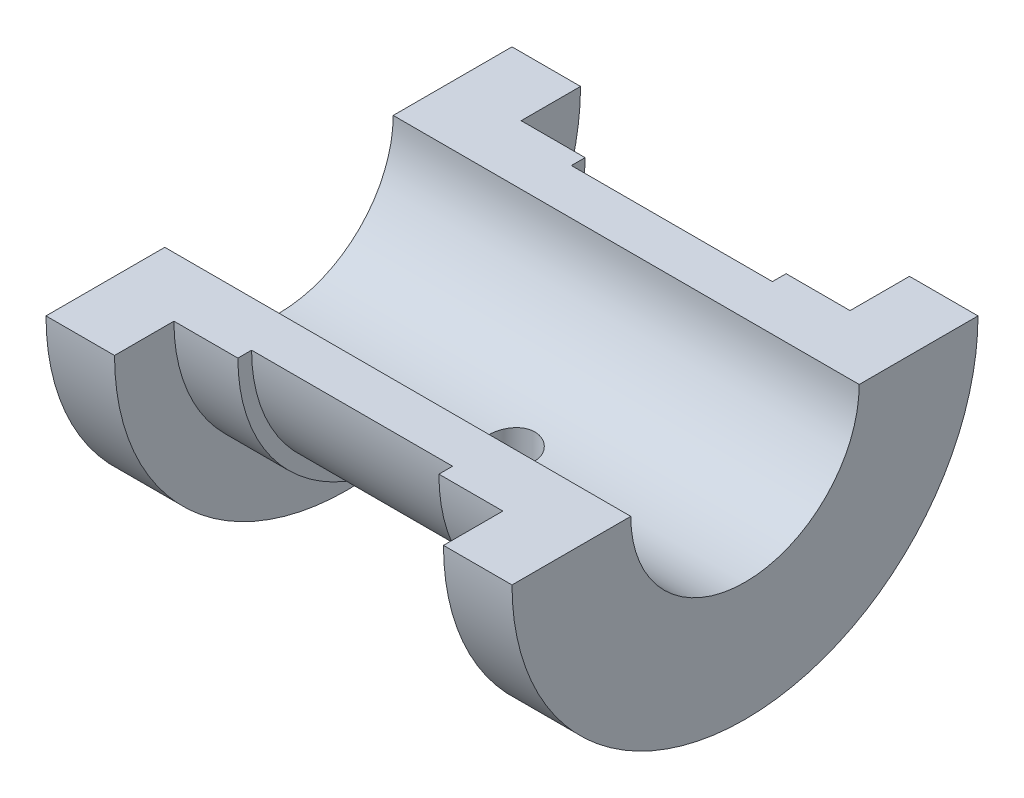
ISO-10303-21;
HEADER;
FILE_DESCRIPTION(('STEP AP214'),'2;1');
FILE_NAME('part.step','',(''),(''),'','','');
FILE_SCHEMA(('AUTOMOTIVE_DESIGN { 1 0 10303 214 1 1 1 1 }'));
ENDSEC;
DATA;
#1=APPLICATION_CONTEXT('core data for automotive mechanical design processes');
#2=APPLICATION_PROTOCOL_DEFINITION('international standard','automotive_design',2000,#1);
#3=PRODUCT_CONTEXT('',#1,'mechanical');
#4=PRODUCT('Part','Part','',(#3));
#5=PRODUCT_RELATED_PRODUCT_CATEGORY('part','',(#4));
#6=PRODUCT_DEFINITION_FORMATION('','',#4);
#7=PRODUCT_DEFINITION_CONTEXT('part definition',#1,'design');
#8=PRODUCT_DEFINITION('design','',#6,#7);
#9=PRODUCT_DEFINITION_SHAPE('','',#8);
#10=(LENGTH_UNIT() NAMED_UNIT(*) SI_UNIT(.MILLI.,.METRE.));
#11=(NAMED_UNIT(*) PLANE_ANGLE_UNIT() SI_UNIT($,.RADIAN.));
#12=(NAMED_UNIT(*) SI_UNIT($,.STERADIAN.) SOLID_ANGLE_UNIT());
#13=UNCERTAINTY_MEASURE_WITH_UNIT(LENGTH_MEASURE(1.E-05),#10,'distance_accuracy_value','');
#14=(GEOMETRIC_REPRESENTATION_CONTEXT(3) GLOBAL_UNCERTAINTY_ASSIGNED_CONTEXT((#13)) GLOBAL_UNIT_ASSIGNED_CONTEXT((#10,
#11,#12)) REPRESENTATION_CONTEXT('',''));
#15=CARTESIAN_POINT('',(0.,0.,0.));
#16=DIRECTION('',(0.,0.,1.));
#17=DIRECTION('',(1.,0.,0.));
#18=AXIS2_PLACEMENT_3D('',#15,#16,#17);
#19=CARTESIAN_POINT('',(0.,0.,0.));
#20=DIRECTION('',(0.,1.,0.));
#21=DIRECTION('',(0.,0.,1.));
#22=AXIS2_PLACEMENT_3D('',#19,#20,#21);
#23=PLANE('',#22);
#24=DIRECTION('',(-1.,0.,0.));
#25=VECTOR('',#24,1.);
#26=CARTESIAN_POINT('',(25.5,0.,-12.5));
#27=LINE('',#26,#25);
#28=CARTESIAN_POINT('',(25.5,0.,-12.5));
#29=VERTEX_POINT('',#28);
#30=CARTESIAN_POINT('',(-25.5,0.,-12.5));
#31=VERTEX_POINT('',#30);
#32=EDGE_CURVE('E132',#29,#31,#27,.T.);
#33=ORIENTED_EDGE('',*,*,#32,.F.);
#34=DIRECTION('',(0.,0.,1.));
#35=VECTOR('',#34,1.);
#36=CARTESIAN_POINT('',(25.5,0.,0.));
#37=LINE('',#36,#35);
#38=CARTESIAN_POINT('',(25.5,0.,-25.5));
#39=VERTEX_POINT('',#38);
#40=EDGE_CURVE('E140',#39,#29,#37,.T.);
#41=ORIENTED_EDGE('',*,*,#40,.F.);
#42=DIRECTION('',(-1.,0.,0.));
#43=VECTOR('',#42,1.);
#44=CARTESIAN_POINT('',(25.5,0.,-25.5));
#45=LINE('',#44,#43);
#46=CARTESIAN_POINT('',(18.,0.,-25.5));
#47=VERTEX_POINT('',#46);
#48=EDGE_CURVE('E209',#39,#47,#45,.T.);
#49=ORIENTED_EDGE('',*,*,#48,.T.);
#50=DIRECTION('',(0.,0.,1.));
#51=VECTOR('',#50,1.);
#52=CARTESIAN_POINT('',(18.,0.,-25.5));
#53=LINE('',#52,#51);
#54=CARTESIAN_POINT('',(18.,0.,-19.));
#55=VERTEX_POINT('',#54);
#56=EDGE_CURVE('E212',#47,#55,#53,.T.);
#57=ORIENTED_EDGE('',*,*,#56,.T.);
#58=DIRECTION('',(-1.,0.,0.));
#59=VECTOR('',#58,1.);
#60=CARTESIAN_POINT('',(18.,0.,-19.));
#61=LINE('',#60,#59);
#62=CARTESIAN_POINT('',(11.,0.,-19.));
#63=VERTEX_POINT('',#62);
#64=EDGE_CURVE('E218',#55,#63,#61,.T.);
#65=ORIENTED_EDGE('',*,*,#64,.T.);
#66=DIRECTION('',(0.,0.,1.));
#67=VECTOR('',#66,1.);
#68=CARTESIAN_POINT('',(11.,0.,-19.));
#69=LINE('',#68,#67);
#70=CARTESIAN_POINT('',(11.,0.,-17.5));
#71=VERTEX_POINT('',#70);
#72=EDGE_CURVE('E221',#63,#71,#69,.T.);
#73=ORIENTED_EDGE('',*,*,#72,.T.);
#74=DIRECTION('',(-1.,0.,0.));
#75=VECTOR('',#74,1.);
#76=CARTESIAN_POINT('',(-11.,0.,-17.5));
#77=LINE('',#76,#75);
#78=CARTESIAN_POINT('',(-11.,0.,-17.5));
#79=VERTEX_POINT('',#78);
#80=EDGE_CURVE('E224',#71,#79,#77,.T.);
#81=ORIENTED_EDGE('',*,*,#80,.T.);
#82=DIRECTION('',(0.,0.,-1.));
#83=VECTOR('',#82,1.);
#84=CARTESIAN_POINT('',(-11.,0.,-19.));
#85=LINE('',#84,#83);
#86=CARTESIAN_POINT('',(-11.,0.,-19.));
#87=VERTEX_POINT('',#86);
#88=EDGE_CURVE('E227',#79,#87,#85,.T.);
#89=ORIENTED_EDGE('',*,*,#88,.T.);
#90=DIRECTION('',(-1.,0.,0.));
#91=VECTOR('',#90,1.);
#92=CARTESIAN_POINT('',(-18.,0.,-19.));
#93=LINE('',#92,#91);
#94=CARTESIAN_POINT('',(-18.,0.,-19.));
#95=VERTEX_POINT('',#94);
#96=EDGE_CURVE('E205',#87,#95,#93,.T.);
#97=ORIENTED_EDGE('',*,*,#96,.T.);
#98=DIRECTION('',(0.,0.,-1.));
#99=VECTOR('',#98,1.);
#100=CARTESIAN_POINT('',(-18.,0.,-25.5));
#101=LINE('',#100,#99);
#102=CARTESIAN_POINT('',(-18.,0.,-25.5));
#103=VERTEX_POINT('',#102);
#104=EDGE_CURVE('E195',#95,#103,#101,.T.);
#105=ORIENTED_EDGE('',*,*,#104,.T.);
#106=DIRECTION('',(-1.,0.,0.));
#107=VECTOR('',#106,1.);
#108=CARTESIAN_POINT('',(-25.5,0.,-25.5));
#109=LINE('',#108,#107);
#110=CARTESIAN_POINT('',(-25.5,0.,-25.5));
#111=VERTEX_POINT('',#110);
#112=EDGE_CURVE('E202',#103,#111,#109,.T.);
#113=ORIENTED_EDGE('',*,*,#112,.T.);
#114=DIRECTION('',(0.,0.,-1.));
#115=VECTOR('',#114,1.);
#116=CARTESIAN_POINT('',(-25.5,0.,0.));
#117=LINE('',#116,#115);
#118=EDGE_CURVE('E149',#31,#111,#117,.T.);
#119=ORIENTED_EDGE('',*,*,#118,.F.);
#120=EDGE_LOOP('',(#33,#41,#49,#57,#65,#73,#81,#89,#97,#105,#113,#119));
#121=FACE_BOUND('',#120,.T.);
#122=ADVANCED_FACE('F33',(#121),#23,.T.);
#123=CARTESIAN_POINT('',(25.5,0.,0.));
#124=DIRECTION('',(1.,0.,0.));
#125=DIRECTION('',(0.,0.,-1.));
#126=AXIS2_PLACEMENT_3D('',#123,#124,#125);
#127=CYLINDRICAL_SURFACE('',#126,25.5);
#128=CARTESIAN_POINT('',(-18.,0.,0.));
#129=DIRECTION('',(1.,0.,0.));
#130=DIRECTION('',(0.,0.,-1.));
#131=AXIS2_PLACEMENT_3D('',#128,#129,#130);
#132=CIRCLE('',#131,25.5);
#133=CARTESIAN_POINT('',(-18.,1.78065548281E-13,25.5));
#134=VERTEX_POINT('',#133);
#135=EDGE_CURVE('E45',#134,#103,#132,.T.);
#136=ORIENTED_EDGE('',*,*,#135,.F.);
#137=DIRECTION('',(-1.,0.,0.));
#138=VECTOR('',#137,1.);
#139=CARTESIAN_POINT('',(-25.5,1.78065548281E-13,25.5));
#140=LINE('',#139,#138);
#141=CARTESIAN_POINT('',(-25.5,1.78065548281E-13,25.5));
#142=VERTEX_POINT('',#141);
#143=EDGE_CURVE('E206',#134,#142,#140,.T.);
#144=ORIENTED_EDGE('',*,*,#143,.T.);
#145=CARTESIAN_POINT('',(-25.5,0.,0.));
#146=DIRECTION('',(1.,0.,0.));
#147=DIRECTION('',(0.,0.,-1.));
#148=AXIS2_PLACEMENT_3D('',#145,#146,#147);
#149=CIRCLE('',#148,25.5);
#150=EDGE_CURVE('E174',#142,#111,#149,.T.);
#151=ORIENTED_EDGE('',*,*,#150,.T.);
#152=ORIENTED_EDGE('',*,*,#112,.F.);
#153=EDGE_LOOP('',(#136,#144,#151,#152));
#154=FACE_BOUND('',#153,.T.);
#155=ADVANCED_FACE('F208',(#154),#127,.T.);
#156=CARTESIAN_POINT('',(-18.,1.78065548281E-13,25.5));
#157=DIRECTION('',(1.,0.,0.));
#158=DIRECTION('',(0.,0.,-1.));
#159=AXIS2_PLACEMENT_3D('',#156,#157,#158);
#160=PLANE('',#159);
#161=CARTESIAN_POINT('',(-18.,0.,0.));
#162=DIRECTION('',(1.,0.,0.));
#163=DIRECTION('',(0.,0.,-1.));
#164=AXIS2_PLACEMENT_3D('',#161,#162,#163);
#165=CIRCLE('',#164,19.);
#166=CARTESIAN_POINT('',(-18.,1.32676290876039E-13,19.));
#167=VERTEX_POINT('',#166);
#168=EDGE_CURVE('E191',#167,#95,#165,.T.);
#169=ORIENTED_EDGE('',*,*,#168,.F.);
#170=DIRECTION('',(0.,0.,1.));
#171=VECTOR('',#170,1.);
#172=CARTESIAN_POINT('',(-18.,1.78065548281E-13,25.5));
#173=LINE('',#172,#171);
#174=EDGE_CURVE('E172',#167,#134,#173,.T.);
#175=ORIENTED_EDGE('',*,*,#174,.T.);
#176=ORIENTED_EDGE('',*,*,#135,.T.);
#177=ORIENTED_EDGE('',*,*,#104,.F.);
#178=EDGE_LOOP('',(#169,#175,#176,#177));
#179=FACE_BOUND('',#178,.T.);
#180=ADVANCED_FACE('F35',(#179),#160,.T.);
#181=CARTESIAN_POINT('',(25.5,0.,0.));
#182=DIRECTION('',(1.,0.,0.));
#183=DIRECTION('',(0.,0.,-1.));
#184=AXIS2_PLACEMENT_3D('',#181,#182,#183);
#185=CYLINDRICAL_SURFACE('',#184,19.);
#186=CARTESIAN_POINT('',(-11.,0.,0.));
#187=DIRECTION('',(1.,0.,0.));
#188=DIRECTION('',(0.,0.,-1.));
#189=AXIS2_PLACEMENT_3D('',#186,#187,#188);
#190=CIRCLE('',#189,19.);
#191=CARTESIAN_POINT('',(-11.,1.32676290876039E-13,19.));
#192=VERTEX_POINT('',#191);
#193=EDGE_CURVE('E189',#192,#87,#190,.T.);
#194=ORIENTED_EDGE('',*,*,#193,.F.);
#195=DIRECTION('',(-1.,0.,0.));
#196=VECTOR('',#195,1.);
#197=CARTESIAN_POINT('',(-18.,1.32676290876039E-13,19.));
#198=LINE('',#197,#196);
#199=EDGE_CURVE('E169',#192,#167,#198,.T.);
#200=ORIENTED_EDGE('',*,*,#199,.T.);
#201=ORIENTED_EDGE('',*,*,#168,.T.);
#202=ORIENTED_EDGE('',*,*,#96,.F.);
#203=EDGE_LOOP('',(#194,#200,#201,#202));
#204=FACE_BOUND('',#203,.T.);
#205=ADVANCED_FACE('F255',(#204),#185,.T.);
#206=CARTESIAN_POINT('',(-11.,1.32676290876039E-13,19.));
#207=DIRECTION('',(1.,0.,0.));
#208=DIRECTION('',(0.,0.,-1.));
#209=AXIS2_PLACEMENT_3D('',#206,#207,#208);
#210=PLANE('',#209);
#211=CARTESIAN_POINT('',(-11.,0.,0.));
#212=DIRECTION('',(1.,0.,0.));
#213=DIRECTION('',(0.,0.,-1.));
#214=AXIS2_PLACEMENT_3D('',#211,#212,#213);
#215=CIRCLE('',#214,17.5);
#216=CARTESIAN_POINT('',(-11.,1.2220184685951E-13,17.5));
#217=VERTEX_POINT('',#216);
#218=EDGE_CURVE('E187',#217,#79,#215,.T.);
#219=ORIENTED_EDGE('',*,*,#218,.F.);
#220=DIRECTION('',(0.,0.,1.));
#221=VECTOR('',#220,1.);
#222=CARTESIAN_POINT('',(-11.,1.32676290876039E-13,19.));
#223=LINE('',#222,#221);
#224=EDGE_CURVE('E166',#217,#192,#223,.T.);
#225=ORIENTED_EDGE('',*,*,#224,.T.);
#226=ORIENTED_EDGE('',*,*,#193,.T.);
#227=ORIENTED_EDGE('',*,*,#88,.F.);
#228=EDGE_LOOP('',(#219,#225,#226,#227));
#229=FACE_BOUND('',#228,.T.);
#230=ADVANCED_FACE('F252',(#229),#210,.T.);
#231=CARTESIAN_POINT('',(25.5,0.,0.));
#232=DIRECTION('',(1.,0.,0.));
#233=DIRECTION('',(0.,0.,-1.));
#234=AXIS2_PLACEMENT_3D('',#231,#232,#233);
#235=CYLINDRICAL_SURFACE('',#234,17.5);
#236=CARTESIAN_POINT('',(0.,-17.3205080756888,-2.49999999999999));
#237=CARTESIAN_POINT('',(0.139655214050539,-17.3205103214296,-2.4999941764498));
#238=CARTESIAN_POINT('',(0.279393390965435,-17.3222153996634,-2.488258306336));
#239=CARTESIAN_POINT('',(0.554968295528884,-17.3288474891277,-2.44163425172346));
#240=CARTESIAN_POINT('',(0.690800994393875,-17.3337777110364,-2.40672299527128));
#241=CARTESIAN_POINT('',(0.954535875036129,-17.346290533042,-2.31480923545586));
#242=CARTESIAN_POINT('',(1.08244384762566,-17.3538711688453,-2.25782308902599));
#243=CARTESIAN_POINT('',(1.32686216183505,-17.3708283324759,-2.12341469861513));
#244=CARTESIAN_POINT('',(1.44337418380036,-17.3802045949313,-2.04599547375905));
#245=CARTESIAN_POINT('',(1.66256036980916,-17.3997728156945,-1.87231683550245));
#246=CARTESIAN_POINT('',(1.76513964233235,-17.4099696809091,-1.77593820534161));
#247=CARTESIAN_POINT('',(1.95272694655072,-17.4299862889805,-1.56733384870893));
#248=CARTESIAN_POINT('',(2.03773404080034,-17.4398060116945,-1.4551072773139));
#249=CARTESIAN_POINT('',(2.1881113721996,-17.4580129627861,-1.21738798002561));
#250=CARTESIAN_POINT('',(2.25339464314803,-17.4663937786684,-1.09183970777011));
#251=CARTESIAN_POINT('',(2.36191341915977,-17.4807243931613,-0.831420932453869));
#252=CARTESIAN_POINT('',(2.40514998330924,-17.4866743085456,-0.696550877549161));
#253=CARTESIAN_POINT('',(2.46806150870533,-17.4954381251122,-0.422292579426188));
#254=CARTESIAN_POINT('',(2.48789508745779,-17.4982731289764,-0.282941406337348));
#255=CARTESIAN_POINT('',(2.50392987320824,-17.5005599435479,-0.00286195659799968));
#256=CARTESIAN_POINT('',(2.50013227745763,-17.5000119256529,0.137866249925722));
#257=CARTESIAN_POINT('',(2.46913827723023,-17.4956113682908,0.415623740232335));
#258=CARTESIAN_POINT('',(2.44211250139685,-17.4917829266554,0.552672499713791));
#259=CARTESIAN_POINT('',(2.36569680037598,-17.4812785676579,0.820269493910864));
#260=CARTESIAN_POINT('',(2.31630634376525,-17.4746025826336,0.950817574077351));
#261=CARTESIAN_POINT('',(2.19638656902053,-17.4591117546373,1.20222745845967));
#262=CARTESIAN_POINT('',(2.12578481110144,-17.4502896021464,1.32305424098883));
#263=CARTESIAN_POINT('',(1.96549938407467,-17.4314908337029,1.55120977517205));
#264=CARTESIAN_POINT('',(1.87581457419597,-17.4215141487494,1.65853771926478));
#265=CARTESIAN_POINT('',(1.67895674790501,-17.4014150617975,1.85765373882982));
#266=CARTESIAN_POINT('',(1.57163483406351,-17.3912921538904,1.94929461665229));
#267=CARTESIAN_POINT('',(1.34305684821314,-17.3721286734458,2.11328736987653));
#268=CARTESIAN_POINT('',(1.22180070481798,-17.3630881064538,2.18563914645222));
#269=CARTESIAN_POINT('',(0.968649637617275,-17.3471131710366,2.30901626900993));
#270=CARTESIAN_POINT('',(0.836747742646744,-17.3401801971233,2.36002750314722));
#271=CARTESIAN_POINT('',(0.56612802521764,-17.3292308226119,2.439132796354));
#272=CARTESIAN_POINT('',(0.427410637010548,-17.3252142364516,2.46722831350377));
#273=CARTESIAN_POINT('',(0.148404328212451,-17.3205872594665,2.49950488360241));
#274=CARTESIAN_POINT('',(0.00813996750552049,-17.3199472150388,2.50389413880589));
#275=CARTESIAN_POINT('',(-0.271122256281437,-17.3220671566589,2.489185103089));
#276=CARTESIAN_POINT('',(-0.410120154779109,-17.3248270473289,2.47008747104212));
#277=CARTESIAN_POINT('',(-0.682265225035556,-17.3334087065645,2.40912297319001));
#278=CARTESIAN_POINT('',(-0.815435908831674,-17.3392166418156,2.36735894805525));
#279=CARTESIAN_POINT('',(-1.07288599682062,-17.3532286401521,2.26235382714329));
#280=CARTESIAN_POINT('',(-1.19716499945215,-17.3614328113701,2.19911176212676));
#281=CARTESIAN_POINT('',(-1.43423984965186,-17.3793831051677,2.05244200414031));
#282=CARTESIAN_POINT('',(-1.54695120151544,-17.3891394056538,1.96887900033906));
#283=CARTESIAN_POINT('',(-1.75682465453188,-17.4090636358241,1.78412847276705));
#284=CARTESIAN_POINT('',(-1.8539859600739,-17.4192315865368,1.6829400477527));
#285=CARTESIAN_POINT('',(-2.03074402304224,-17.4389256551739,1.46489635785669));
#286=CARTESIAN_POINT('',(-2.1102031528994,-17.4484463695232,1.34792896515541));
#287=CARTESIAN_POINT('',(-2.24834445391965,-17.4656902694975,1.10218588096399));
#288=CARTESIAN_POINT('',(-2.30702714967243,-17.4734135005061,0.973410487720567));
#289=CARTESIAN_POINT('',(-2.40172764289464,-17.4861684730555,0.708144905742415));
#290=CARTESIAN_POINT('',(-2.43782198578435,-17.4912092957152,0.571682498904912));
#291=CARTESIAN_POINT('',(-2.48656933388325,-17.4980694889566,0.294556573807231));
#292=CARTESIAN_POINT('',(-2.4992237373173,-17.4998890516906,0.153893306642845));
#293=CARTESIAN_POINT('',(-2.50070029868059,-17.5001000958988,-0.126303913283942));
#294=CARTESIAN_POINT('',(-2.48973352377306,-17.4985219377795,-0.265836777188218));
#295=CARTESIAN_POINT('',(-2.44472981244618,-17.4921758034385,-0.541053291849848));
#296=CARTESIAN_POINT('',(-2.41069293049507,-17.4874078347479,-0.676736951694339));
#297=CARTESIAN_POINT('',(-2.32058752821483,-17.4752152756766,-0.94035464312152));
#298=CARTESIAN_POINT('',(-2.26453227439438,-17.4677922852398,-1.06829328775858));
#299=CARTESIAN_POINT('',(-2.13200356349716,-17.4511070012847,-1.31298213231449));
#300=CARTESIAN_POINT('',(-2.05552956867624,-17.4418446593271,-1.42973203745873));
#301=CARTESIAN_POINT('',(-1.88356535597191,-17.4224130932707,-1.64980243700276));
#302=CARTESIAN_POINT('',(-1.78791886646362,-17.4122368231533,-1.75300020789776));
#303=CARTESIAN_POINT('',(-1.58065304970162,-17.3921777929122,-1.94195895909258));
#304=CARTESIAN_POINT('',(-1.46902997123847,-17.3822951023791,-2.02771583289178));
#305=CARTESIAN_POINT('',(-1.23231820209395,-17.3638885978291,-2.17974404343877));
#306=CARTESIAN_POINT('',(-1.10716413704061,-17.3553719241531,-2.24591442873637));
#307=CARTESIAN_POINT('',(-0.847459629299107,-17.3407453505435,-2.35619878131273));
#308=CARTESIAN_POINT('',(-0.712919252117549,-17.3346329177213,-2.40033597402073));
#309=CARTESIAN_POINT('',(-0.481454467704522,-17.3269411528971,-2.45511568957329));
#310=CARTESIAN_POINT('',(-0.385969580734816,-17.3245412999151,-2.47192203162012));
#311=CARTESIAN_POINT('',(-0.193669753794692,-17.3213239914062,-2.49436614385581));
#312=CARTESIAN_POINT('',(-0.0968548286929663,-17.3205065182042,-2.50000403879626));
#313=CARTESIAN_POINT('',(0.,-17.3205080756888,-2.49999999999999));
#314=B_SPLINE_CURVE_WITH_KNOTS('',3,(#236,#237,#238,#239,#240,#241,#242,#243,#244,#245,#246,
#247,#248,#249,#250,#251,#252,#253,#254,#255,#256,#257,#258,#259,#260,#261,#262,#263,#264,#265,
#266,#267,#268,#269,#270,#271,#272,#273,#274,#275,#276,#277,#278,#279,#280,#281,#282,#283,#284,
#285,#286,#287,#288,#289,#290,#291,#292,#293,#294,#295,#296,#297,#298,#299,#300,#301,#302,#303,
#304,#305,#306,#307,#308,#309,#310,#311,#312,#313),.UNSPECIFIED.,.T.,.F.,(4,2,2,2,2,2,2,2,2,2,2,
2,2,2,2,2,2,2,2,2,2,2,2,2,2,2,2,2,2,2,2,2,2,2,2,2,2,2,4),(0.,0.418611686761215,
0.837640743157849,1.25635990174198,1.67501722635384,2.09639644561274,2.51779813893171,
2.94103163345003,3.36424479463774,3.78457277673271,4.20487946347623,4.622124811343,
5.03938007419638,5.45807684551731,5.87679865326297,6.29925647482802,6.72171646077845,
7.14445536663835,7.56716737238592,7.98616076353197,8.40514240099879,8.8222387600537,
9.23935394391403,9.65932651264326,10.0793205622075,10.502474019027,10.9256167907707,
11.3473177767363,11.7689936068437,12.1869171913008,12.6048397890487,13.022510965389,
13.4401931425248,13.8614293663582,14.2827646567287,14.7062351939403,15.1292583986303,
15.4195806495844,15.7098996576198),.UNSPECIFIED.);
#315=CARTESIAN_POINT('',(0.,-17.3205080756888,-2.49999999999999));
#316=VERTEX_POINT('',#315);
#317=EDGE_CURVE('E11',#316,#316,#314,.T.);
#318=ORIENTED_EDGE('',*,*,#317,.F.);
#319=EDGE_LOOP('',(#318));
#320=FACE_BOUND('',#319,.T.);
#321=CARTESIAN_POINT('',(11.,0.,0.));
#322=DIRECTION('',(1.,0.,0.));
#323=DIRECTION('',(0.,0.,-1.));
#324=AXIS2_PLACEMENT_3D('',#321,#322,#323);
#325=CIRCLE('',#324,17.5);
#326=CARTESIAN_POINT('',(11.,1.2220184685951E-13,17.5));
#327=VERTEX_POINT('',#326);
#328=EDGE_CURVE('E185',#327,#71,#325,.T.);
#329=ORIENTED_EDGE('',*,*,#328,.F.);
#330=DIRECTION('',(-1.,0.,0.));
#331=VECTOR('',#330,1.);
#332=CARTESIAN_POINT('',(-11.,1.2220184685951E-13,17.5));
#333=LINE('',#332,#331);
#334=EDGE_CURVE('E163',#327,#217,#333,.T.);
#335=ORIENTED_EDGE('',*,*,#334,.T.);
#336=ORIENTED_EDGE('',*,*,#218,.T.);
#337=ORIENTED_EDGE('',*,*,#80,.F.);
#338=EDGE_LOOP('',(#329,#335,#336,#337));
#339=FACE_BOUND('',#338,.T.);
#340=ADVANCED_FACE('F249',(#320,#339),#235,.T.);
#341=CARTESIAN_POINT('',(11.,1.32676290876039E-13,19.));
#342=DIRECTION('',(-1.,0.,0.));
#343=DIRECTION('',(0.,0.,1.));
#344=AXIS2_PLACEMENT_3D('',#341,#342,#343);
#345=PLANE('',#344);
#346=CARTESIAN_POINT('',(11.,0.,0.));
#347=DIRECTION('',(1.,0.,0.));
#348=DIRECTION('',(0.,0.,-1.));
#349=AXIS2_PLACEMENT_3D('',#346,#347,#348);
#350=CIRCLE('',#349,19.);
#351=CARTESIAN_POINT('',(11.,1.32676290876039E-13,19.));
#352=VERTEX_POINT('',#351);
#353=EDGE_CURVE('E183',#352,#63,#350,.T.);
#354=ORIENTED_EDGE('',*,*,#353,.F.);
#355=DIRECTION('',(0.,0.,-1.));
#356=VECTOR('',#355,1.);
#357=CARTESIAN_POINT('',(11.,1.32676290876039E-13,19.));
#358=LINE('',#357,#356);
#359=EDGE_CURVE('E160',#352,#327,#358,.T.);
#360=ORIENTED_EDGE('',*,*,#359,.T.);
#361=ORIENTED_EDGE('',*,*,#328,.T.);
#362=ORIENTED_EDGE('',*,*,#72,.F.);
#363=EDGE_LOOP('',(#354,#360,#361,#362));
#364=FACE_BOUND('',#363,.T.);
#365=ADVANCED_FACE('F244',(#364),#345,.T.);
#366=CARTESIAN_POINT('',(25.5,0.,0.));
#367=DIRECTION('',(1.,0.,0.));
#368=DIRECTION('',(0.,0.,-1.));
#369=AXIS2_PLACEMENT_3D('',#366,#367,#368);
#370=CYLINDRICAL_SURFACE('',#369,19.);
#371=CARTESIAN_POINT('',(18.,0.,0.));
#372=DIRECTION('',(1.,0.,0.));
#373=DIRECTION('',(0.,0.,-1.));
#374=AXIS2_PLACEMENT_3D('',#371,#372,#373);
#375=CIRCLE('',#374,19.);
#376=CARTESIAN_POINT('',(18.,1.32676290876039E-13,19.));
#377=VERTEX_POINT('',#376);
#378=EDGE_CURVE('E181',#377,#55,#375,.T.);
#379=ORIENTED_EDGE('',*,*,#378,.F.);
#380=DIRECTION('',(-1.,0.,0.));
#381=VECTOR('',#380,1.);
#382=CARTESIAN_POINT('',(18.,1.32676290876039E-13,19.));
#383=LINE('',#382,#381);
#384=EDGE_CURVE('E157',#377,#352,#383,.T.);
#385=ORIENTED_EDGE('',*,*,#384,.T.);
#386=ORIENTED_EDGE('',*,*,#353,.T.);
#387=ORIENTED_EDGE('',*,*,#64,.F.);
#388=EDGE_LOOP('',(#379,#385,#386,#387));
#389=FACE_BOUND('',#388,.T.);
#390=ADVANCED_FACE('F241',(#389),#370,.T.);
#391=CARTESIAN_POINT('',(18.,1.78065548281E-13,25.5));
#392=DIRECTION('',(-1.,0.,0.));
#393=DIRECTION('',(0.,0.,1.));
#394=AXIS2_PLACEMENT_3D('',#391,#392,#393);
#395=PLANE('',#394);
#396=CARTESIAN_POINT('',(18.,0.,0.));
#397=DIRECTION('',(1.,0.,0.));
#398=DIRECTION('',(0.,0.,-1.));
#399=AXIS2_PLACEMENT_3D('',#396,#397,#398);
#400=CIRCLE('',#399,25.5);
#401=CARTESIAN_POINT('',(18.,1.78065548281E-13,25.5));
#402=VERTEX_POINT('',#401);
#403=EDGE_CURVE('E179',#402,#47,#400,.T.);
#404=ORIENTED_EDGE('',*,*,#403,.F.);
#405=DIRECTION('',(0.,0.,-1.));
#406=VECTOR('',#405,1.);
#407=CARTESIAN_POINT('',(18.,1.78065548281E-13,25.5));
#408=LINE('',#407,#406);
#409=EDGE_CURVE('E154',#402,#377,#408,.T.);
#410=ORIENTED_EDGE('',*,*,#409,.T.);
#411=ORIENTED_EDGE('',*,*,#378,.T.);
#412=ORIENTED_EDGE('',*,*,#56,.F.);
#413=EDGE_LOOP('',(#404,#410,#411,#412));
#414=FACE_BOUND('',#413,.T.);
#415=ADVANCED_FACE('F236',(#414),#395,.T.);
#416=CARTESIAN_POINT('',(25.5,0.,0.));
#417=DIRECTION('',(1.,0.,0.));
#418=DIRECTION('',(0.,0.,-1.));
#419=AXIS2_PLACEMENT_3D('',#416,#417,#418);
#420=CYLINDRICAL_SURFACE('',#419,25.5);
#421=CARTESIAN_POINT('',(25.5,0.,0.));
#422=DIRECTION('',(1.,0.,0.));
#423=DIRECTION('',(0.,0.,-1.));
#424=AXIS2_PLACEMENT_3D('',#421,#422,#423);
#425=CIRCLE('',#424,25.5);
#426=CARTESIAN_POINT('',(25.5,1.78065548281E-13,25.5));
#427=VERTEX_POINT('',#426);
#428=EDGE_CURVE('E177',#427,#39,#425,.T.);
#429=ORIENTED_EDGE('',*,*,#428,.F.);
#430=DIRECTION('',(-1.,0.,0.));
#431=VECTOR('',#430,1.);
#432=CARTESIAN_POINT('',(25.5,1.78065548281E-13,25.5));
#433=LINE('',#432,#431);
#434=EDGE_CURVE('E146',#427,#402,#433,.T.);
#435=ORIENTED_EDGE('',*,*,#434,.T.);
#436=ORIENTED_EDGE('',*,*,#403,.T.);
#437=ORIENTED_EDGE('',*,*,#48,.F.);
#438=EDGE_LOOP('',(#429,#435,#436,#437));
#439=FACE_BOUND('',#438,.T.);
#440=ADVANCED_FACE('F234',(#439),#420,.T.);
#441=CARTESIAN_POINT('',(25.5,0.,0.));
#442=DIRECTION('',(1.,0.,0.));
#443=DIRECTION('',(0.,0.,-1.));
#444=AXIS2_PLACEMENT_3D('',#441,#442,#443);
#445=PLANE('',#444);
#446=CARTESIAN_POINT('',(25.5,0.,0.));
#447=DIRECTION('',(-1.,0.,0.));
#448=DIRECTION('',(0.,0.,1.));
#449=AXIS2_PLACEMENT_3D('',#446,#447,#448);
#450=CIRCLE('',#449,12.5);
#451=CARTESIAN_POINT('',(25.5,1.32676290876039E-13,12.5));
#452=VERTEX_POINT('',#451);
#453=EDGE_CURVE('E126',#29,#452,#450,.T.);
#454=ORIENTED_EDGE('',*,*,#453,.T.);
#455=EDGE_CURVE('E138',#452,#427,#37,.T.);
#456=ORIENTED_EDGE('',*,*,#455,.T.);
#457=ORIENTED_EDGE('',*,*,#428,.T.);
#458=ORIENTED_EDGE('',*,*,#40,.T.);
#459=EDGE_LOOP('',(#454,#456,#457,#458));
#460=FACE_BOUND('',#459,.T.);
#461=ADVANCED_FACE('F136',(#460),#445,.T.);
#462=CARTESIAN_POINT('',(-25.5,0.,0.));
#463=DIRECTION('',(-1.,0.,0.));
#464=DIRECTION('',(0.,0.,1.));
#465=AXIS2_PLACEMENT_3D('',#462,#463,#464);
#466=PLANE('',#465);
#467=CARTESIAN_POINT('',(-25.5,0.,0.));
#468=DIRECTION('',(-1.,0.,0.));
#469=DIRECTION('',(0.,0.,1.));
#470=AXIS2_PLACEMENT_3D('',#467,#468,#469);
#471=CIRCLE('',#470,12.5);
#472=CARTESIAN_POINT('',(-25.5,0.,12.5));
#473=VERTEX_POINT('',#472);
#474=EDGE_CURVE('E52',#31,#473,#471,.T.);
#475=ORIENTED_EDGE('',*,*,#474,.F.);
#476=ORIENTED_EDGE('',*,*,#118,.T.);
#477=ORIENTED_EDGE('',*,*,#150,.F.);
#478=EDGE_CURVE('E147',#142,#473,#117,.T.);
#479=ORIENTED_EDGE('',*,*,#478,.T.);
#480=EDGE_LOOP('',(#475,#476,#477,#479));
#481=FACE_BOUND('',#480,.T.);
#482=ADVANCED_FACE('F230',(#481),#466,.T.);
#483=DIRECTION('',(-1.,0.,0.));
#484=VECTOR('',#483,1.);
#485=CARTESIAN_POINT('',(25.5,1.32676290876039E-13,12.5));
#486=LINE('',#485,#484);
#487=EDGE_CURVE('E123',#452,#473,#486,.T.);
#488=ORIENTED_EDGE('',*,*,#487,.T.);
#489=ORIENTED_EDGE('',*,*,#478,.F.);
#490=ORIENTED_EDGE('',*,*,#143,.F.);
#491=ORIENTED_EDGE('',*,*,#174,.F.);
#492=ORIENTED_EDGE('',*,*,#199,.F.);
#493=ORIENTED_EDGE('',*,*,#224,.F.);
#494=ORIENTED_EDGE('',*,*,#334,.F.);
#495=ORIENTED_EDGE('',*,*,#359,.F.);
#496=ORIENTED_EDGE('',*,*,#384,.F.);
#497=ORIENTED_EDGE('',*,*,#409,.F.);
#498=ORIENTED_EDGE('',*,*,#434,.F.);
#499=ORIENTED_EDGE('',*,*,#455,.F.);
#500=EDGE_LOOP('',(#488,#489,#490,#491,#492,#493,#494,#495,#496,#497,#498,#499));
#501=FACE_BOUND('',#500,.T.);
#502=ADVANCED_FACE('F143',(#501),#23,.T.);
#503=CARTESIAN_POINT('',(25.5,0.,0.));
#504=DIRECTION('',(-1.,0.,0.));
#505=DIRECTION('',(0.,0.,1.));
#506=AXIS2_PLACEMENT_3D('',#503,#504,#505);
#507=CYLINDRICAL_SURFACE('',#506,12.5);
#508=CARTESIAN_POINT('',(0.,-12.2474487139158,-2.49999999999999));
#509=CARTESIAN_POINT('',(0.138910938727889,-12.2474514756661,-2.49999486468817));
#510=CARTESIAN_POINT('',(0.277886558333349,-12.2498377067175,-2.48838292929535));
#511=CARTESIAN_POINT('',(0.551906262857828,-12.2591107826218,-2.4422807089571));
#512=CARTESIAN_POINT('',(0.686947111589948,-12.2660012286196,-2.40777211767623));
#513=CARTESIAN_POINT('',(0.949093258385525,-12.2834718430463,-2.31698945654936));
#514=CARTESIAN_POINT('',(1.07620630383147,-12.2940483405268,-2.26073703538154));
#515=CARTESIAN_POINT('',(1.31918711174238,-12.3176949870164,-2.12812276917626));
#516=CARTESIAN_POINT('',(1.43505550134475,-12.3307649968364,-2.05176204650287));
#517=CARTESIAN_POINT('',(1.65390250963465,-12.3581324923562,-1.87994768913359));
#518=CARTESIAN_POINT('',(1.75669896970993,-12.3724434459311,-1.78426413978329));
#519=CARTESIAN_POINT('',(1.94489383394745,-12.4005618075649,-1.57701697255327));
#520=CARTESIAN_POINT('',(2.03029101854297,-12.4143691802707,-1.46545224244496));
#521=CARTESIAN_POINT('',(2.18197004407114,-12.440069910439,-1.22840338981064));
#522=CARTESIAN_POINT('',(2.24807878454159,-12.4519455360387,-1.10280641918052));
#523=CARTESIAN_POINT('',(2.35818734262034,-12.4722934220907,-0.842010375968175));
#524=CARTESIAN_POINT('',(2.40218922975247,-12.4807660011029,-0.70681220355138));
#525=CARTESIAN_POINT('',(2.46626798404905,-12.4932580172104,-0.432541933196234));
#526=CARTESIAN_POINT('',(2.48665244392751,-12.4973346572031,-0.293544348037034));
#527=CARTESIAN_POINT('',(2.50387737959578,-12.50077302959,-0.0140464210938404));
#528=CARTESIAN_POINT('',(2.50072012411455,-12.5001352163189,0.126453774579608));
#529=CARTESIAN_POINT('',(2.47118454946111,-12.4942608717128,0.402855001858971));
#530=CARTESIAN_POINT('',(2.44513755708037,-12.4890899591459,0.538793035746174));
#531=CARTESIAN_POINT('',(2.37108741885276,-12.4748044289851,0.804329066450751));
#532=CARTESIAN_POINT('',(2.32308339452031,-12.4656896536009,0.93392680936782));
#533=CARTESIAN_POINT('',(2.20617489963182,-12.4444324004989,1.18404865800222));
#534=CARTESIAN_POINT('',(2.13714062223777,-12.4322712043805,1.30451043533475));
#535=CARTESIAN_POINT('',(1.98022730690849,-12.4062617368445,1.53226261464939));
#536=CARTESIAN_POINT('',(1.8923461005737,-12.3924132713805,1.6395514988125));
#537=CARTESIAN_POINT('',(1.69841594472881,-12.3642741091114,1.83987857763364));
#538=CARTESIAN_POINT('',(1.59207703317602,-12.3499799114378,1.93263579143407));
#539=CARTESIAN_POINT('',(1.36520889387311,-12.3227892899689,2.09904623294201));
#540=CARTESIAN_POINT('',(1.24467939779201,-12.3098928926136,2.17269909931937));
#541=CARTESIAN_POINT('',(0.992447920445484,-12.286951186823,2.2989070370047));
#542=CARTESIAN_POINT('',(0.860722580900842,-12.2769120390886,2.35141661944427));
#543=CARTESIAN_POINT('',(0.590071690690019,-12.2609119080317,2.43347585406895));
#544=CARTESIAN_POINT('',(0.451147080952288,-12.2549503932106,2.4630284986416));
#545=CARTESIAN_POINT('',(0.172587855002387,-12.2478869816956,2.49791501509012));
#546=CARTESIAN_POINT('',(0.0330060642241471,-12.2467036764288,2.50365464724477));
#547=CARTESIAN_POINT('',(-0.24512055799921,-12.2491121422213,2.49184407077684));
#548=CARTESIAN_POINT('',(-0.383665447797158,-12.2527036425096,2.4742951828061));
#549=CARTESIAN_POINT('',(-0.654421600730587,-12.2641808123728,2.41675552018538));
#550=CARTESIAN_POINT('',(-0.786680857589406,-12.2720249753623,2.37698155209824));
#551=CARTESIAN_POINT('',(-1.04265819757185,-12.2910872337915,2.27635258827129));
#552=CARTESIAN_POINT('',(-1.1663755760893,-12.3023056071567,2.21549585593293));
#553=CARTESIAN_POINT('',(-1.4035327748754,-12.3270351490509,2.07351035553899));
#554=CARTESIAN_POINT('',(-1.51681761575206,-12.3405742966225,1.99212769495688));
#555=CARTESIAN_POINT('',(-1.72827078000228,-12.3683430956658,1.81173893053177));
#556=CARTESIAN_POINT('',(-1.82643754562313,-12.3825728180954,1.71273101286134));
#557=CARTESIAN_POINT('',(-2.00640639796394,-12.4103836467303,1.49808068374472));
#558=CARTESIAN_POINT('',(-2.08793413662499,-12.423951442717,1.38220624732407));
#559=CARTESIAN_POINT('',(-2.23036470374895,-12.4486781907154,1.13816974158688));
#560=CARTESIAN_POINT('',(-2.29126839836195,-12.4598372438802,1.01000818858376));
#561=CARTESIAN_POINT('',(-2.39032217936658,-12.4784323515266,0.745756702060028));
#562=CARTESIAN_POINT('',(-2.42860129556563,-12.485889478565,0.609716683695193));
#563=CARTESIAN_POINT('',(-2.4817281191596,-12.4963308984415,0.332973636699778));
#564=CARTESIAN_POINT('',(-2.49657864868919,-12.4993157299961,0.192271171778028));
#565=CARTESIAN_POINT('',(-2.50231745240722,-12.5004635113528,-0.0871822347590534));
#566=CARTESIAN_POINT('',(-2.49361820114056,-12.4987094637332,-0.225924530353735));
#567=CARTESIAN_POINT('',(-2.45341512363042,-12.4907510890084,-0.499927578289124));
#568=CARTESIAN_POINT('',(-2.42191158412967,-12.4845468178607,-0.635188374384305));
#569=CARTESIAN_POINT('',(-2.33717751977102,-12.4683874591229,-0.898131874362661));
#570=CARTESIAN_POINT('',(-2.28399655467256,-12.4584409311903,-1.02583110810041));
#571=CARTESIAN_POINT('',(-2.15746939667222,-12.4358680530919,-1.27055305046517));
#572=CARTESIAN_POINT('',(-2.08412161023874,-12.4232414911746,-1.38757491441961));
#573=CARTESIAN_POINT('',(-1.91795153234678,-12.3964399789184,-1.60965972526479));
#574=CARTESIAN_POINT('',(-1.82483415904056,-12.3822433354474,-1.7144992902871));
#575=CARTESIAN_POINT('',(-1.62237439975307,-12.3540305726965,-1.90720654439626));
#576=CARTESIAN_POINT('',(-1.51302817630018,-12.3400144969679,-1.99507020802228));
#577=CARTESIAN_POINT('',(-1.27980170827392,-12.3135835683482,-2.15223054862495));
#578=CARTESIAN_POINT('',(-1.15577759719686,-12.3011875892806,-2.22131703654522));
#579=CARTESIAN_POINT('',(-0.897668066849743,-12.2796309281602,-2.33756012316556));
#580=CARTESIAN_POINT('',(-0.763591903282021,-12.2704673131245,-2.3847366149354));
#581=CARTESIAN_POINT('',(-0.524343861392812,-12.258242028446,-2.44667284964413));
#582=CARTESIAN_POINT('',(-0.420536451215102,-12.2542196228651,-2.4666347463092));
#583=CARTESIAN_POINT('',(-0.211165113622161,-12.248821961477,-2.49330004489927));
#584=CARTESIAN_POINT('',(-0.105601246888828,-12.2474466144104,-2.5000039039066));
#585=CARTESIAN_POINT('',(0.,-12.2474487139158,-2.49999999999999));
#586=B_SPLINE_CURVE_WITH_KNOTS('',3,(#508,#509,#510,#511,#512,#513,#514,#515,#516,#517,#518,
#519,#520,#521,#522,#523,#524,#525,#526,#527,#528,#529,#530,#531,#532,#533,#534,#535,#536,#537,
#538,#539,#540,#541,#542,#543,#544,#545,#546,#547,#548,#549,#550,#551,#552,#553,#554,#555,#556,
#557,#558,#559,#560,#561,#562,#563,#564,#565,#566,#567,#568,#569,#570,#571,#572,#573,#574,#575,
#576,#577,#578,#579,#580,#581,#582,#583,#584,#585),.UNSPECIFIED.,.T.,.F.,(4,2,2,2,2,2,2,2,2,2,2,
2,2,2,2,2,2,2,2,2,2,2,2,2,2,2,2,2,2,2,2,2,2,2,2,2,2,2,4),(0.,0.416346159673568,
0.833025598210739,1.24929124485146,1.66553366214965,2.08705631371091,2.50860850088554,
2.93383501093625,3.35902170616398,3.778606222077,4.19815030290619,4.61171974083842,
5.02530572684374,5.44149810555757,5.85773839425164,6.28123366906206,6.70473695306799,
7.12914657931939,7.5535008754006,7.97059394511482,8.38766336321052,8.80073354458295,
9.21383775885994,9.632326494363,10.0508583217552,10.4758150433362,10.9007539157526,
11.3232453394662,11.7456858672907,12.1607754353671,12.5758597841689,12.9900004268863,
13.4041738033671,13.8250288006399,14.2459834722445,14.6714724644901,15.0965743772549,
15.413095090954,15.729604892137),.UNSPECIFIED.);
#587=CARTESIAN_POINT('',(0.,-12.2474487139158,-2.49999999999999));
#588=VERTEX_POINT('',#587);
#589=EDGE_CURVE('E300',#588,#588,#586,.T.);
#590=ORIENTED_EDGE('',*,*,#589,.T.);
#591=EDGE_LOOP('',(#590));
#592=FACE_BOUND('',#591,.T.);
#593=ORIENTED_EDGE('',*,*,#474,.T.);
#594=ORIENTED_EDGE('',*,*,#487,.F.);
#595=ORIENTED_EDGE('',*,*,#453,.F.);
#596=ORIENTED_EDGE('',*,*,#32,.T.);
#597=EDGE_LOOP('',(#593,#594,#595,#596));
#598=FACE_BOUND('',#597,.T.);
#599=ADVANCED_FACE('F125',(#592,#598),#507,.F.);
#600=CARTESIAN_POINT('',(0.,-17.5,0.));
#601=DIRECTION('',(0.,-1.,0.));
#602=DIRECTION('',(0.,0.,-1.));
#603=AXIS2_PLACEMENT_3D('',#600,#601,#602);
#604=CYLINDRICAL_SURFACE('',#603,2.49999999999999);
#605=ORIENTED_EDGE('',*,*,#317,.T.);
#606=EDGE_LOOP('',(#605));
#607=FACE_BOUND('',#606,.T.);
#608=ORIENTED_EDGE('',*,*,#589,.F.);
#609=EDGE_LOOP('',(#608));
#610=FACE_BOUND('',#609,.T.);
#611=ADVANCED_FACE('F274',(#607,#610),#604,.F.);
#612=CLOSED_SHELL('',(#122,#155,#180,#205,#230,#340,#365,#390,#415,#440,#461,#482,#502,#599,#611));
#613=MANIFOLD_SOLID_BREP('B2',#612);
#614=ADVANCED_BREP_SHAPE_REPRESENTATION('',(#18,#613),#14);
#615=SHAPE_DEFINITION_REPRESENTATION(#9,#614);
ENDSEC;
END-ISO-10303-21;
